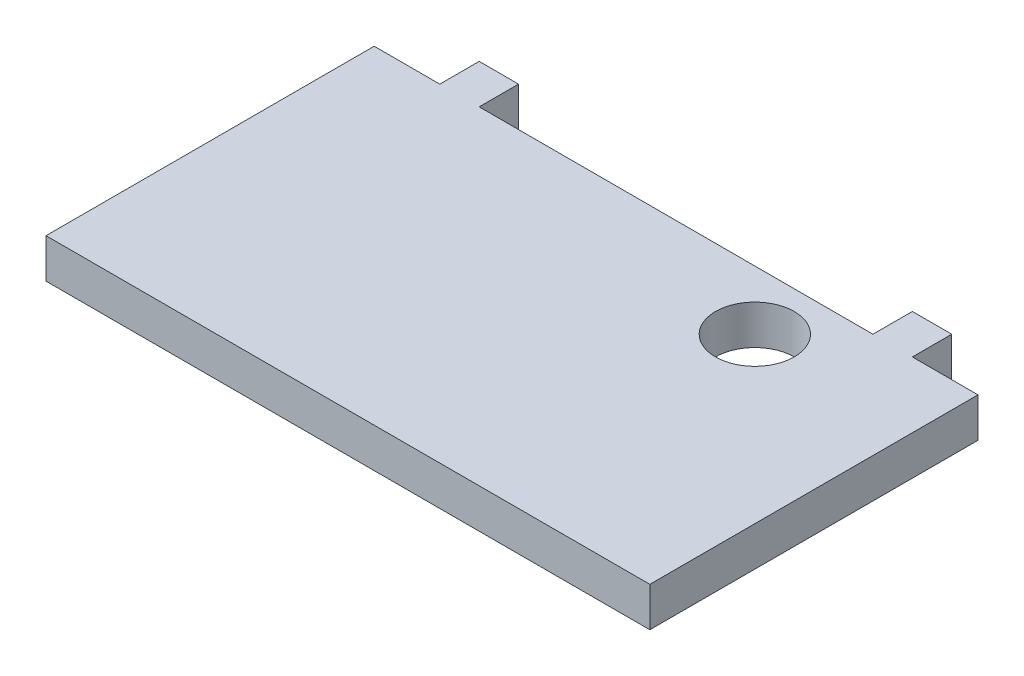
ISO-10303-21;
HEADER;
FILE_DESCRIPTION(('STEP AP214'),'2;1');
FILE_NAME('part.step','',(''),(''),'','','');
FILE_SCHEMA(('AUTOMOTIVE_DESIGN { 1 0 10303 214 1 1 1 1 }'));
ENDSEC;
DATA;
#1=APPLICATION_CONTEXT('core data for automotive mechanical design processes');
#2=APPLICATION_PROTOCOL_DEFINITION('international standard','automotive_design',2000,#1);
#3=PRODUCT_CONTEXT('',#1,'mechanical');
#4=PRODUCT('Part','Part','',(#3));
#5=PRODUCT_RELATED_PRODUCT_CATEGORY('part','',(#4));
#6=PRODUCT_DEFINITION_FORMATION('','',#4);
#7=PRODUCT_DEFINITION_CONTEXT('part definition',#1,'design');
#8=PRODUCT_DEFINITION('design','',#6,#7);
#9=PRODUCT_DEFINITION_SHAPE('','',#8);
#10=(LENGTH_UNIT() NAMED_UNIT(*) SI_UNIT(.MILLI.,.METRE.));
#11=(NAMED_UNIT(*) PLANE_ANGLE_UNIT() SI_UNIT($,.RADIAN.));
#12=(NAMED_UNIT(*) SI_UNIT($,.STERADIAN.) SOLID_ANGLE_UNIT());
#13=UNCERTAINTY_MEASURE_WITH_UNIT(LENGTH_MEASURE(1.E-05),#10,'distance_accuracy_value','');
#14=(GEOMETRIC_REPRESENTATION_CONTEXT(3) GLOBAL_UNCERTAINTY_ASSIGNED_CONTEXT((#13)) GLOBAL_UNIT_ASSIGNED_CONTEXT((#10,
#11,#12)) REPRESENTATION_CONTEXT('',''));
#15=CARTESIAN_POINT('',(0.,0.,0.));
#16=DIRECTION('',(0.,0.,1.));
#17=DIRECTION('',(1.,0.,0.));
#18=AXIS2_PLACEMENT_3D('',#15,#16,#17);
#19=CARTESIAN_POINT('',(0.,0.,0.));
#20=DIRECTION('',(0.,0.,-1.));
#21=DIRECTION('',(-1.,0.,0.));
#22=AXIS2_PLACEMENT_3D('',#19,#20,#21);
#23=PLANE('',#22);
#24=DIRECTION('',(1.,0.,0.));
#25=VECTOR('',#24,1.);
#26=CARTESIAN_POINT('',(-46.,0.,0.));
#27=LINE('',#26,#25);
#28=CARTESIAN_POINT('',(-30.,0.,0.));
#29=VERTEX_POINT('',#28);
#30=CARTESIAN_POINT('',(30.,0.,0.));
#31=VERTEX_POINT('',#30);
#32=EDGE_CURVE('E194',#29,#31,#27,.T.);
#33=ORIENTED_EDGE('',*,*,#32,.F.);
#34=DIRECTION('',(0.,-1.,0.));
#35=VECTOR('',#34,1.);
#36=CARTESIAN_POINT('',(-30.,6.,0.));
#37=LINE('',#36,#35);
#38=CARTESIAN_POINT('',(-30.,6.,0.));
#39=VERTEX_POINT('',#38);
#40=EDGE_CURVE('E145',#39,#29,#37,.T.);
#41=ORIENTED_EDGE('',*,*,#40,.F.);
#42=DIRECTION('',(-1.,0.,0.));
#43=VECTOR('',#42,1.);
#44=CARTESIAN_POINT('',(-46.,6.,0.));
#45=LINE('',#44,#43);
#46=CARTESIAN_POINT('',(30.,6.,0.));
#47=VERTEX_POINT('',#46);
#48=EDGE_CURVE('E199',#47,#39,#45,.T.);
#49=ORIENTED_EDGE('',*,*,#48,.F.);
#50=DIRECTION('',(0.,1.,0.));
#51=VECTOR('',#50,1.);
#52=CARTESIAN_POINT('',(30.,6.,0.));
#53=LINE('',#52,#51);
#54=EDGE_CURVE('E147',#31,#47,#53,.T.);
#55=ORIENTED_EDGE('',*,*,#54,.F.);
#56=EDGE_LOOP('',(#33,#41,#49,#55));
#57=FACE_BOUND('',#56,.T.);
#58=ADVANCED_FACE('F34',(#57),#23,.T.);
#59=CARTESIAN_POINT('',(-36.,6.,0.));
#60=VERTEX_POINT('',#59);
#61=CARTESIAN_POINT('',(-46.,6.,0.));
#62=VERTEX_POINT('',#61);
#63=EDGE_CURVE('E196',#60,#62,#45,.T.);
#64=ORIENTED_EDGE('',*,*,#63,.F.);
#65=DIRECTION('',(0.,1.,0.));
#66=VECTOR('',#65,1.);
#67=CARTESIAN_POINT('',(-36.,0.,0.));
#68=LINE('',#67,#66);
#69=CARTESIAN_POINT('',(-36.,0.,0.));
#70=VERTEX_POINT('',#69);
#71=EDGE_CURVE('E141',#70,#60,#68,.T.);
#72=ORIENTED_EDGE('',*,*,#71,.F.);
#73=CARTESIAN_POINT('',(-46.,0.,0.));
#74=VERTEX_POINT('',#73);
#75=EDGE_CURVE('E191',#74,#70,#27,.T.);
#76=ORIENTED_EDGE('',*,*,#75,.F.);
#77=DIRECTION('',(0.,-1.,0.));
#78=VECTOR('',#77,1.);
#79=CARTESIAN_POINT('',(-46.,0.,0.));
#80=LINE('',#79,#78);
#81=EDGE_CURVE('E177',#62,#74,#80,.T.);
#82=ORIENTED_EDGE('',*,*,#81,.F.);
#83=EDGE_LOOP('',(#64,#72,#76,#82));
#84=FACE_BOUND('',#83,.T.);
#85=ADVANCED_FACE('F238',(#84),#23,.T.);
#86=DIRECTION('',(0.,-1.,0.));
#87=VECTOR('',#86,1.);
#88=CARTESIAN_POINT('',(36.,0.,0.));
#89=LINE('',#88,#87);
#90=CARTESIAN_POINT('',(36.,6.,0.));
#91=VERTEX_POINT('',#90);
#92=CARTESIAN_POINT('',(36.,0.,0.));
#93=VERTEX_POINT('',#92);
#94=EDGE_CURVE('E150',#91,#93,#89,.T.);
#95=ORIENTED_EDGE('',*,*,#94,.F.);
#96=CARTESIAN_POINT('',(46.,6.,0.));
#97=VERTEX_POINT('',#96);
#98=EDGE_CURVE('E182',#97,#91,#45,.T.);
#99=ORIENTED_EDGE('',*,*,#98,.F.);
#100=DIRECTION('',(0.,1.,0.));
#101=VECTOR('',#100,1.);
#102=CARTESIAN_POINT('',(46.,6.,0.));
#103=LINE('',#102,#101);
#104=CARTESIAN_POINT('',(46.,0.,0.));
#105=VERTEX_POINT('',#104);
#106=EDGE_CURVE('E193',#105,#97,#103,.T.);
#107=ORIENTED_EDGE('',*,*,#106,.F.);
#108=EDGE_CURVE('E57',#93,#105,#27,.T.);
#109=ORIENTED_EDGE('',*,*,#108,.F.);
#110=EDGE_LOOP('',(#95,#99,#107,#109));
#111=FACE_BOUND('',#110,.T.);
#112=ADVANCED_FACE('F211',(#111),#23,.T.);
#113=CARTESIAN_POINT('',(-46.,0.,50.));
#114=DIRECTION('',(1.,0.,0.));
#115=DIRECTION('',(0.,0.,-1.));
#116=AXIS2_PLACEMENT_3D('',#113,#114,#115);
#117=PLANE('',#116);
#118=ORIENTED_EDGE('',*,*,#81,.T.);
#119=DIRECTION('',(0.,0.,-1.));
#120=VECTOR('',#119,1.);
#121=CARTESIAN_POINT('',(-46.,0.,50.));
#122=LINE('',#121,#120);
#123=CARTESIAN_POINT('',(-46.,0.,50.));
#124=VERTEX_POINT('',#123);
#125=EDGE_CURVE('E11',#124,#74,#122,.T.);
#126=ORIENTED_EDGE('',*,*,#125,.F.);
#127=DIRECTION('',(0.,-1.,0.));
#128=VECTOR('',#127,1.);
#129=CARTESIAN_POINT('',(-46.,0.,50.));
#130=LINE('',#129,#128);
#131=CARTESIAN_POINT('',(-46.,6.,50.));
#132=VERTEX_POINT('',#131);
#133=EDGE_CURVE('E178',#132,#124,#130,.T.);
#134=ORIENTED_EDGE('',*,*,#133,.F.);
#135=DIRECTION('',(0.,0.,-1.));
#136=VECTOR('',#135,1.);
#137=CARTESIAN_POINT('',(-46.,6.,50.));
#138=LINE('',#137,#136);
#139=EDGE_CURVE('E188',#132,#62,#138,.T.);
#140=ORIENTED_EDGE('',*,*,#139,.T.);
#141=EDGE_LOOP('',(#118,#126,#134,#140));
#142=FACE_BOUND('',#141,.T.);
#143=ADVANCED_FACE('F36',(#142),#117,.F.);
#144=CARTESIAN_POINT('',(-46.,0.,50.));
#145=DIRECTION('',(0.,1.,0.));
#146=DIRECTION('',(0.,0.,1.));
#147=AXIS2_PLACEMENT_3D('',#144,#145,#146);
#148=PLANE('',#147);
#149=CARTESIAN_POINT('',(21.,0.,9.));
#150=DIRECTION('',(0.,-1.,0.));
#151=DIRECTION('',(0.,0.,-1.));
#152=AXIS2_PLACEMENT_3D('',#149,#150,#151);
#153=CIRCLE('',#152,6.);
#154=CARTESIAN_POINT('',(21.,0.,3.));
#155=VERTEX_POINT('',#154);
#156=EDGE_CURVE('E269',#155,#155,#153,.T.);
#157=ORIENTED_EDGE('',*,*,#156,.F.);
#158=EDGE_LOOP('',(#157));
#159=FACE_BOUND('',#158,.T.);
#160=ORIENTED_EDGE('',*,*,#75,.T.);
#161=DIRECTION('',(0.,0.,1.));
#162=VECTOR('',#161,1.);
#163=CARTESIAN_POINT('',(-36.,0.,-6.));
#164=LINE('',#163,#162);
#165=CARTESIAN_POINT('',(-36.,0.,-6.));
#166=VERTEX_POINT('',#165);
#167=EDGE_CURVE('E130',#166,#70,#164,.T.);
#168=ORIENTED_EDGE('',*,*,#167,.F.);
#169=DIRECTION('',(-1.,0.,0.));
#170=VECTOR('',#169,1.);
#171=CARTESIAN_POINT('',(-30.,0.,-6.));
#172=LINE('',#171,#170);
#173=CARTESIAN_POINT('',(-30.,0.,-6.));
#174=VERTEX_POINT('',#173);
#175=EDGE_CURVE('E123',#174,#166,#172,.T.);
#176=ORIENTED_EDGE('',*,*,#175,.F.);
#177=DIRECTION('',(0.,0.,1.));
#178=VECTOR('',#177,1.);
#179=CARTESIAN_POINT('',(-30.,0.,-6.));
#180=LINE('',#179,#178);
#181=EDGE_CURVE('E128',#174,#29,#180,.T.);
#182=ORIENTED_EDGE('',*,*,#181,.T.);
#183=ORIENTED_EDGE('',*,*,#32,.T.);
#184=DIRECTION('',(0.,0.,1.));
#185=VECTOR('',#184,1.);
#186=CARTESIAN_POINT('',(30.,0.,-6.));
#187=LINE('',#186,#185);
#188=CARTESIAN_POINT('',(30.,0.,-6.));
#189=VERTEX_POINT('',#188);
#190=EDGE_CURVE('E174',#189,#31,#187,.T.);
#191=ORIENTED_EDGE('',*,*,#190,.F.);
#192=DIRECTION('',(-1.,0.,0.));
#193=VECTOR('',#192,1.);
#194=CARTESIAN_POINT('',(30.,0.,-6.));
#195=LINE('',#194,#193);
#196=CARTESIAN_POINT('',(36.,0.,-6.));
#197=VERTEX_POINT('',#196);
#198=EDGE_CURVE('E155',#197,#189,#195,.T.);
#199=ORIENTED_EDGE('',*,*,#198,.F.);
#200=DIRECTION('',(0.,0.,1.));
#201=VECTOR('',#200,1.);
#202=CARTESIAN_POINT('',(36.,0.,-6.));
#203=LINE('',#202,#201);
#204=EDGE_CURVE('E163',#197,#93,#203,.T.);
#205=ORIENTED_EDGE('',*,*,#204,.T.);
#206=ORIENTED_EDGE('',*,*,#108,.T.);
#207=DIRECTION('',(0.,0.,-1.));
#208=VECTOR('',#207,1.);
#209=CARTESIAN_POINT('',(46.,0.,50.));
#210=LINE('',#209,#208);
#211=CARTESIAN_POINT('',(46.,0.,50.));
#212=VERTEX_POINT('',#211);
#213=EDGE_CURVE('E42',#212,#105,#210,.T.);
#214=ORIENTED_EDGE('',*,*,#213,.F.);
#215=DIRECTION('',(1.,0.,0.));
#216=VECTOR('',#215,1.);
#217=CARTESIAN_POINT('',(-46.,0.,50.));
#218=LINE('',#217,#216);
#219=EDGE_CURVE('E181',#124,#212,#218,.T.);
#220=ORIENTED_EDGE('',*,*,#219,.F.);
#221=ORIENTED_EDGE('',*,*,#125,.T.);
#222=EDGE_LOOP('',(#160,#168,#176,#182,#183,#191,#199,#205,#206,#214,#220,#221));
#223=FACE_BOUND('',#222,.T.);
#224=ADVANCED_FACE('F126',(#159,#223),#148,.F.);
#225=CARTESIAN_POINT('',(46.,6.,50.));
#226=DIRECTION('',(-1.,0.,0.));
#227=DIRECTION('',(0.,0.,1.));
#228=AXIS2_PLACEMENT_3D('',#225,#226,#227);
#229=PLANE('',#228);
#230=ORIENTED_EDGE('',*,*,#106,.T.);
#231=DIRECTION('',(0.,0.,-1.));
#232=VECTOR('',#231,1.);
#233=CARTESIAN_POINT('',(46.,6.,50.));
#234=LINE('',#233,#232);
#235=CARTESIAN_POINT('',(46.,6.,50.));
#236=VERTEX_POINT('',#235);
#237=EDGE_CURVE('E202',#236,#97,#234,.T.);
#238=ORIENTED_EDGE('',*,*,#237,.F.);
#239=DIRECTION('',(0.,1.,0.));
#240=VECTOR('',#239,1.);
#241=CARTESIAN_POINT('',(46.,6.,50.));
#242=LINE('',#241,#240);
#243=EDGE_CURVE('E184',#212,#236,#242,.T.);
#244=ORIENTED_EDGE('',*,*,#243,.F.);
#245=ORIENTED_EDGE('',*,*,#213,.T.);
#246=EDGE_LOOP('',(#230,#238,#244,#245));
#247=FACE_BOUND('',#246,.T.);
#248=ADVANCED_FACE('F208',(#247),#229,.F.);
#249=CARTESIAN_POINT('',(-46.,6.,50.));
#250=DIRECTION('',(0.,-1.,0.));
#251=DIRECTION('',(0.,0.,-1.));
#252=AXIS2_PLACEMENT_3D('',#249,#250,#251);
#253=PLANE('',#252);
#254=CARTESIAN_POINT('',(21.,6.,9.));
#255=DIRECTION('',(0.,-1.,0.));
#256=DIRECTION('',(0.,0.,-1.));
#257=AXIS2_PLACEMENT_3D('',#254,#255,#256);
#258=CIRCLE('',#257,6.);
#259=CARTESIAN_POINT('',(21.,6.,3.));
#260=VERTEX_POINT('',#259);
#261=EDGE_CURVE('E271',#260,#260,#258,.T.);
#262=ORIENTED_EDGE('',*,*,#261,.T.);
#263=EDGE_LOOP('',(#262));
#264=FACE_BOUND('',#263,.T.);
#265=ORIENTED_EDGE('',*,*,#98,.T.);
#266=DIRECTION('',(0.,0.,1.));
#267=VECTOR('',#266,1.);
#268=CARTESIAN_POINT('',(36.,6.,-6.));
#269=LINE('',#268,#267);
#270=CARTESIAN_POINT('',(36.,6.,-6.));
#271=VERTEX_POINT('',#270);
#272=EDGE_CURVE('E168',#271,#91,#269,.T.);
#273=ORIENTED_EDGE('',*,*,#272,.F.);
#274=DIRECTION('',(1.,0.,0.));
#275=VECTOR('',#274,1.);
#276=CARTESIAN_POINT('',(36.,6.,-6.));
#277=LINE('',#276,#275);
#278=CARTESIAN_POINT('',(30.,6.,-6.));
#279=VERTEX_POINT('',#278);
#280=EDGE_CURVE('E160',#279,#271,#277,.T.);
#281=ORIENTED_EDGE('',*,*,#280,.F.);
#282=DIRECTION('',(0.,0.,1.));
#283=VECTOR('',#282,1.);
#284=CARTESIAN_POINT('',(30.,6.,-6.));
#285=LINE('',#284,#283);
#286=EDGE_CURVE('E171',#279,#47,#285,.T.);
#287=ORIENTED_EDGE('',*,*,#286,.T.);
#288=ORIENTED_EDGE('',*,*,#48,.T.);
#289=DIRECTION('',(0.,0.,1.));
#290=VECTOR('',#289,1.);
#291=CARTESIAN_POINT('',(-30.,6.,-6.));
#292=LINE('',#291,#290);
#293=CARTESIAN_POINT('',(-30.,6.,-6.));
#294=VERTEX_POINT('',#293);
#295=EDGE_CURVE('E278',#294,#39,#292,.T.);
#296=ORIENTED_EDGE('',*,*,#295,.F.);
#297=DIRECTION('',(1.,0.,0.));
#298=VECTOR('',#297,1.);
#299=CARTESIAN_POINT('',(-36.,6.,-6.));
#300=LINE('',#299,#298);
#301=CARTESIAN_POINT('',(-36.,6.,-6.));
#302=VERTEX_POINT('',#301);
#303=EDGE_CURVE('E138',#302,#294,#300,.T.);
#304=ORIENTED_EDGE('',*,*,#303,.F.);
#305=DIRECTION('',(0.,0.,1.));
#306=VECTOR('',#305,1.);
#307=CARTESIAN_POINT('',(-36.,6.,-6.));
#308=LINE('',#307,#306);
#309=EDGE_CURVE('E49',#302,#60,#308,.T.);
#310=ORIENTED_EDGE('',*,*,#309,.T.);
#311=ORIENTED_EDGE('',*,*,#63,.T.);
#312=ORIENTED_EDGE('',*,*,#139,.F.);
#313=DIRECTION('',(-1.,0.,0.));
#314=VECTOR('',#313,1.);
#315=CARTESIAN_POINT('',(-46.,6.,50.));
#316=LINE('',#315,#314);
#317=EDGE_CURVE('E186',#236,#132,#316,.T.);
#318=ORIENTED_EDGE('',*,*,#317,.F.);
#319=ORIENTED_EDGE('',*,*,#237,.T.);
#320=EDGE_LOOP('',(#265,#273,#281,#287,#288,#296,#304,#310,#311,#312,#318,#319));
#321=FACE_BOUND('',#320,.T.);
#322=ADVANCED_FACE('F213',(#264,#321),#253,.F.);
#323=CARTESIAN_POINT('',(0.,0.,50.));
#324=DIRECTION('',(0.,0.,-1.));
#325=DIRECTION('',(-1.,0.,0.));
#326=AXIS2_PLACEMENT_3D('',#323,#324,#325);
#327=PLANE('',#326);
#328=ORIENTED_EDGE('',*,*,#133,.T.);
#329=ORIENTED_EDGE('',*,*,#219,.T.);
#330=ORIENTED_EDGE('',*,*,#243,.T.);
#331=ORIENTED_EDGE('',*,*,#317,.T.);
#332=EDGE_LOOP('',(#328,#329,#330,#331));
#333=FACE_BOUND('',#332,.T.);
#334=ADVANCED_FACE('F240',(#333),#327,.F.);
#335=CARTESIAN_POINT('',(30.,6.,-6.));
#336=DIRECTION('',(1.,0.,0.));
#337=DIRECTION('',(0.,0.,-1.));
#338=AXIS2_PLACEMENT_3D('',#335,#336,#337);
#339=PLANE('',#338);
#340=ORIENTED_EDGE('',*,*,#54,.T.);
#341=ORIENTED_EDGE('',*,*,#286,.F.);
#342=DIRECTION('',(0.,1.,0.));
#343=VECTOR('',#342,1.);
#344=CARTESIAN_POINT('',(30.,6.,-6.));
#345=LINE('',#344,#343);
#346=EDGE_CURVE('E158',#189,#279,#345,.T.);
#347=ORIENTED_EDGE('',*,*,#346,.F.);
#348=ORIENTED_EDGE('',*,*,#190,.T.);
#349=EDGE_LOOP('',(#340,#341,#347,#348));
#350=FACE_BOUND('',#349,.T.);
#351=ADVANCED_FACE('F227',(#350),#339,.F.);
#352=CARTESIAN_POINT('',(36.,0.,-6.));
#353=DIRECTION('',(-1.,0.,0.));
#354=DIRECTION('',(0.,-1.,0.));
#355=AXIS2_PLACEMENT_3D('',#352,#353,#354);
#356=PLANE('',#355);
#357=ORIENTED_EDGE('',*,*,#94,.T.);
#358=ORIENTED_EDGE('',*,*,#204,.F.);
#359=DIRECTION('',(0.,-1.,0.));
#360=VECTOR('',#359,1.);
#361=CARTESIAN_POINT('',(36.,0.,-6.));
#362=LINE('',#361,#360);
#363=EDGE_CURVE('E162',#271,#197,#362,.T.);
#364=ORIENTED_EDGE('',*,*,#363,.F.);
#365=ORIENTED_EDGE('',*,*,#272,.T.);
#366=EDGE_LOOP('',(#357,#358,#364,#365));
#367=FACE_BOUND('',#366,.T.);
#368=ADVANCED_FACE('F218',(#367),#356,.F.);
#369=CARTESIAN_POINT('',(0.,0.,-6.));
#370=DIRECTION('',(0.,0.,1.));
#371=DIRECTION('',(1.,0.,0.));
#372=AXIS2_PLACEMENT_3D('',#369,#370,#371);
#373=PLANE('',#372);
#374=ORIENTED_EDGE('',*,*,#198,.T.);
#375=ORIENTED_EDGE('',*,*,#346,.T.);
#376=ORIENTED_EDGE('',*,*,#280,.T.);
#377=ORIENTED_EDGE('',*,*,#363,.T.);
#378=EDGE_LOOP('',(#374,#375,#376,#377));
#379=FACE_BOUND('',#378,.T.);
#380=ADVANCED_FACE('F222',(#379),#373,.F.);
#381=CARTESIAN_POINT('',(-30.,6.,-6.));
#382=DIRECTION('',(-1.,0.,0.));
#383=DIRECTION('',(0.,0.,1.));
#384=AXIS2_PLACEMENT_3D('',#381,#382,#383);
#385=PLANE('',#384);
#386=ORIENTED_EDGE('',*,*,#40,.T.);
#387=ORIENTED_EDGE('',*,*,#181,.F.);
#388=DIRECTION('',(0.,-1.,0.));
#389=VECTOR('',#388,1.);
#390=CARTESIAN_POINT('',(-30.,6.,-6.));
#391=LINE('',#390,#389);
#392=EDGE_CURVE('E134',#294,#174,#391,.T.);
#393=ORIENTED_EDGE('',*,*,#392,.F.);
#394=ORIENTED_EDGE('',*,*,#295,.T.);
#395=EDGE_LOOP('',(#386,#387,#393,#394));
#396=FACE_BOUND('',#395,.T.);
#397=ADVANCED_FACE('F143',(#396),#385,.F.);
#398=CARTESIAN_POINT('',(-36.,0.,-6.));
#399=DIRECTION('',(1.,0.,0.));
#400=DIRECTION('',(0.,1.,0.));
#401=AXIS2_PLACEMENT_3D('',#398,#399,#400);
#402=PLANE('',#401);
#403=ORIENTED_EDGE('',*,*,#71,.T.);
#404=ORIENTED_EDGE('',*,*,#309,.F.);
#405=DIRECTION('',(0.,1.,0.));
#406=VECTOR('',#405,1.);
#407=CARTESIAN_POINT('',(-36.,0.,-6.));
#408=LINE('',#407,#406);
#409=EDGE_CURVE('E133',#166,#302,#408,.T.);
#410=ORIENTED_EDGE('',*,*,#409,.F.);
#411=ORIENTED_EDGE('',*,*,#167,.T.);
#412=EDGE_LOOP('',(#403,#404,#410,#411));
#413=FACE_BOUND('',#412,.T.);
#414=ADVANCED_FACE('F282',(#413),#402,.F.);
#415=CARTESIAN_POINT('',(0.,0.,-6.));
#416=DIRECTION('',(0.,0.,-1.));
#417=DIRECTION('',(-1.,0.,0.));
#418=AXIS2_PLACEMENT_3D('',#415,#416,#417);
#419=PLANE('',#418);
#420=ORIENTED_EDGE('',*,*,#392,.T.);
#421=ORIENTED_EDGE('',*,*,#175,.T.);
#422=ORIENTED_EDGE('',*,*,#409,.T.);
#423=ORIENTED_EDGE('',*,*,#303,.T.);
#424=EDGE_LOOP('',(#420,#421,#422,#423));
#425=FACE_BOUND('',#424,.T.);
#426=ADVANCED_FACE('F137',(#425),#419,.T.);
#427=CARTESIAN_POINT('',(21.,6.,9.));
#428=DIRECTION('',(0.,-1.,0.));
#429=DIRECTION('',(0.,0.,-1.));
#430=AXIS2_PLACEMENT_3D('',#427,#428,#429);
#431=CYLINDRICAL_SURFACE('',#430,6.);
#432=ORIENTED_EDGE('',*,*,#261,.F.);
#433=EDGE_LOOP('',(#432));
#434=FACE_BOUND('',#433,.T.);
#435=ORIENTED_EDGE('',*,*,#156,.T.);
#436=EDGE_LOOP('',(#435));
#437=FACE_BOUND('',#436,.T.);
#438=ADVANCED_FACE('F289',(#434,#437),#431,.F.);
#439=CLOSED_SHELL('',(#58,#85,#112,#143,#224,#248,#322,#334,#351,#368,#380,#397,#414,#426,#438));
#440=MANIFOLD_SOLID_BREP('B2',#439);
#441=ADVANCED_BREP_SHAPE_REPRESENTATION('',(#18,#440),#14);
#442=SHAPE_DEFINITION_REPRESENTATION(#9,#441);
ENDSEC;
END-ISO-10303-21;
